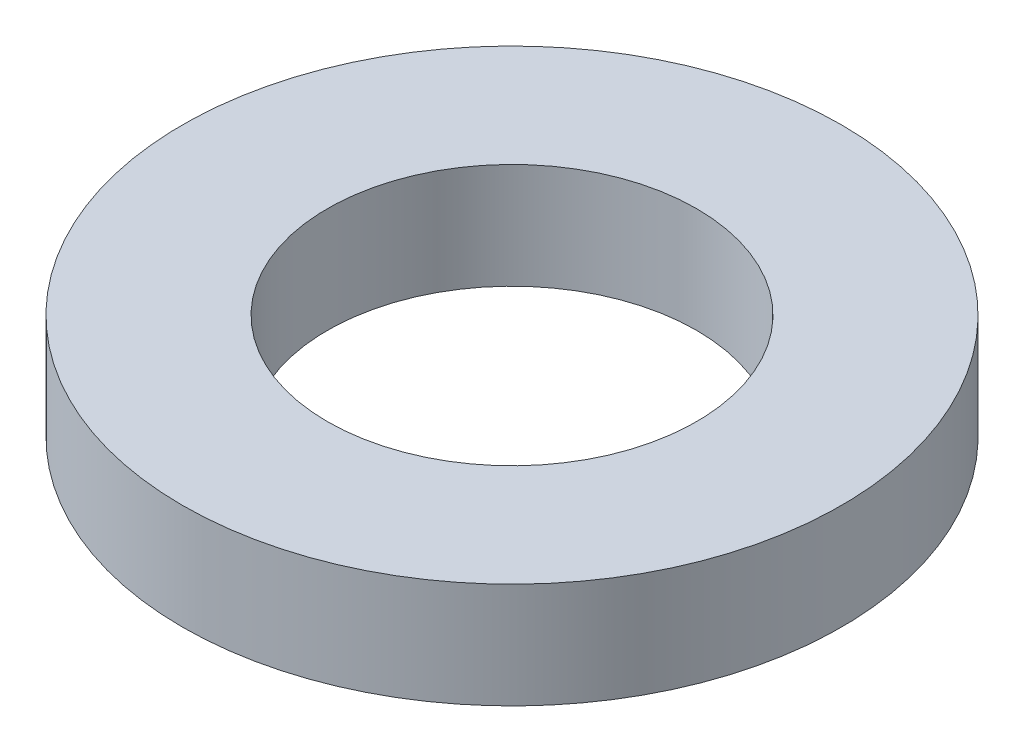
ISO-10303-21;
HEADER;
FILE_DESCRIPTION(('STEP AP214'),'2;1');
FILE_NAME('part.step','',(''),(''),'','','');
FILE_SCHEMA(('AUTOMOTIVE_DESIGN { 1 0 10303 214 1 1 1 1 }'));
ENDSEC;
DATA;
#1=APPLICATION_CONTEXT('core data for automotive mechanical design processes');
#2=APPLICATION_PROTOCOL_DEFINITION('international standard','automotive_design',2000,#1);
#3=PRODUCT_CONTEXT('',#1,'mechanical');
#4=PRODUCT('Part','Part','',(#3));
#5=PRODUCT_RELATED_PRODUCT_CATEGORY('part','',(#4));
#6=PRODUCT_DEFINITION_FORMATION('','',#4);
#7=PRODUCT_DEFINITION_CONTEXT('part definition',#1,'design');
#8=PRODUCT_DEFINITION('design','',#6,#7);
#9=PRODUCT_DEFINITION_SHAPE('','',#8);
#10=(LENGTH_UNIT() NAMED_UNIT(*) SI_UNIT(.MILLI.,.METRE.));
#11=(NAMED_UNIT(*) PLANE_ANGLE_UNIT() SI_UNIT($,.RADIAN.));
#12=(NAMED_UNIT(*) SI_UNIT($,.STERADIAN.) SOLID_ANGLE_UNIT());
#13=UNCERTAINTY_MEASURE_WITH_UNIT(LENGTH_MEASURE(1.E-05),#10,'distance_accuracy_value','');
#14=(GEOMETRIC_REPRESENTATION_CONTEXT(3) GLOBAL_UNCERTAINTY_ASSIGNED_CONTEXT((#13)) GLOBAL_UNIT_ASSIGNED_CONTEXT((#10,
#11,#12)) REPRESENTATION_CONTEXT('',''));
#15=CARTESIAN_POINT('',(0.,0.,0.));
#16=DIRECTION('',(0.,0.,1.));
#17=DIRECTION('',(1.,0.,0.));
#18=AXIS2_PLACEMENT_3D('',#15,#16,#17);
#19=CARTESIAN_POINT('',(0.,20.,0.));
#20=DIRECTION('',(0.,-1.,0.));
#21=DIRECTION('',(0.,0.,-1.));
#22=AXIS2_PLACEMENT_3D('',#19,#20,#21);
#23=CYLINDRICAL_SURFACE('',#22,62.5);
#24=CARTESIAN_POINT('',(0.,20.,0.));
#25=DIRECTION('',(0.,1.,0.));
#26=DIRECTION('',(0.,0.,1.));
#27=AXIS2_PLACEMENT_3D('',#24,#25,#26);
#28=CIRCLE('',#27,62.5);
#29=CARTESIAN_POINT('',(0.,20.,62.5));
#30=VERTEX_POINT('',#29);
#31=EDGE_CURVE('E10',#30,#30,#28,.T.);
#32=ORIENTED_EDGE('',*,*,#31,.F.);
#33=EDGE_LOOP('',(#32));
#34=FACE_BOUND('',#33,.T.);
#35=CARTESIAN_POINT('',(0.,0.,0.));
#36=DIRECTION('',(0.,1.,0.));
#37=DIRECTION('',(0.,0.,1.));
#38=AXIS2_PLACEMENT_3D('',#35,#36,#37);
#39=CIRCLE('',#38,62.5);
#40=CARTESIAN_POINT('',(0.,0.,62.5));
#41=VERTEX_POINT('',#40);
#42=EDGE_CURVE('E37',#41,#41,#39,.T.);
#43=ORIENTED_EDGE('',*,*,#42,.T.);
#44=EDGE_LOOP('',(#43));
#45=FACE_BOUND('',#44,.T.);
#46=ADVANCED_FACE('F40',(#34,#45),#23,.T.);
#47=CARTESIAN_POINT('',(0.,20.,0.));
#48=DIRECTION('',(0.,1.,0.));
#49=DIRECTION('',(0.,0.,1.));
#50=AXIS2_PLACEMENT_3D('',#47,#48,#49);
#51=PLANE('',#50);
#52=CARTESIAN_POINT('',(0.,20.,0.));
#53=DIRECTION('',(0.,1.,0.));
#54=DIRECTION('',(0.,0.,1.));
#55=AXIS2_PLACEMENT_3D('',#52,#53,#54);
#56=CIRCLE('',#55,35.);
#57=CARTESIAN_POINT('',(0.,20.,35.));
#58=VERTEX_POINT('',#57);
#59=EDGE_CURVE('E50',#58,#58,#56,.T.);
#60=ORIENTED_EDGE('',*,*,#59,.F.);
#61=EDGE_LOOP('',(#60));
#62=FACE_BOUND('',#61,.T.);
#63=ORIENTED_EDGE('',*,*,#31,.T.);
#64=EDGE_LOOP('',(#63));
#65=FACE_BOUND('',#64,.T.);
#66=ADVANCED_FACE('F59',(#62,#65),#51,.T.);
#67=CARTESIAN_POINT('',(0.,0.,0.));
#68=DIRECTION('',(0.,1.,0.));
#69=DIRECTION('',(0.,0.,1.));
#70=AXIS2_PLACEMENT_3D('',#67,#68,#69);
#71=PLANE('',#70);
#72=CARTESIAN_POINT('',(0.,0.,0.));
#73=DIRECTION('',(0.,1.,0.));
#74=DIRECTION('',(0.,0.,1.));
#75=AXIS2_PLACEMENT_3D('',#72,#73,#74);
#76=CIRCLE('',#75,35.);
#77=CARTESIAN_POINT('',(0.,0.,35.));
#78=VERTEX_POINT('',#77);
#79=EDGE_CURVE('E47',#78,#78,#76,.T.);
#80=ORIENTED_EDGE('',*,*,#79,.T.);
#81=EDGE_LOOP('',(#80));
#82=FACE_BOUND('',#81,.T.);
#83=ORIENTED_EDGE('',*,*,#42,.F.);
#84=EDGE_LOOP('',(#83));
#85=FACE_BOUND('',#84,.T.);
#86=ADVANCED_FACE('F58',(#82,#85),#71,.F.);
#87=CARTESIAN_POINT('',(0.,20.,0.));
#88=DIRECTION('',(0.,-1.,0.));
#89=DIRECTION('',(0.,0.,-1.));
#90=AXIS2_PLACEMENT_3D('',#87,#88,#89);
#91=CYLINDRICAL_SURFACE('',#90,35.);
#92=ORIENTED_EDGE('',*,*,#59,.T.);
#93=EDGE_LOOP('',(#92));
#94=FACE_BOUND('',#93,.T.);
#95=ORIENTED_EDGE('',*,*,#79,.F.);
#96=EDGE_LOOP('',(#95));
#97=FACE_BOUND('',#96,.T.);
#98=ADVANCED_FACE('F54',(#94,#97),#91,.F.);
#99=CLOSED_SHELL('',(#46,#66,#86,#98));
#100=MANIFOLD_SOLID_BREP('B2',#99);
#101=ADVANCED_BREP_SHAPE_REPRESENTATION('',(#18,#100),#14);
#102=SHAPE_DEFINITION_REPRESENTATION(#9,#101);
ENDSEC;
END-ISO-10303-21;
